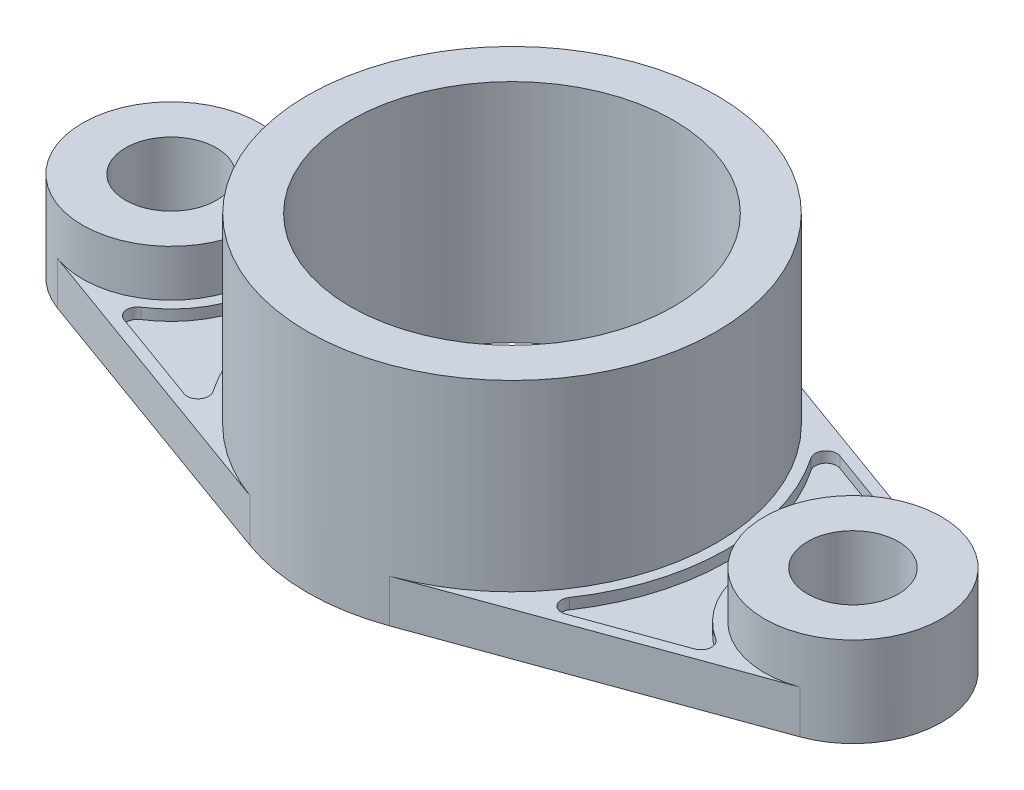
ISO-10303-21;
HEADER;
FILE_DESCRIPTION(('STEP AP214'),'2;1');
FILE_NAME('part.step','',(''),(''),'','','');
FILE_SCHEMA(('AUTOMOTIVE_DESIGN { 1 0 10303 214 1 1 1 1 }'));
ENDSEC;
DATA;
#1=APPLICATION_CONTEXT('core data for automotive mechanical design processes');
#2=APPLICATION_PROTOCOL_DEFINITION('international standard','automotive_design',2000,#1);
#3=PRODUCT_CONTEXT('',#1,'mechanical');
#4=PRODUCT('Part','Part','',(#3));
#5=PRODUCT_RELATED_PRODUCT_CATEGORY('part','',(#4));
#6=PRODUCT_DEFINITION_FORMATION('','',#4);
#7=PRODUCT_DEFINITION_CONTEXT('part definition',#1,'design');
#8=PRODUCT_DEFINITION('design','',#6,#7);
#9=PRODUCT_DEFINITION_SHAPE('','',#8);
#10=(LENGTH_UNIT() NAMED_UNIT(*) SI_UNIT(.MILLI.,.METRE.));
#11=(NAMED_UNIT(*) PLANE_ANGLE_UNIT() SI_UNIT($,.RADIAN.));
#12=(NAMED_UNIT(*) SI_UNIT($,.STERADIAN.) SOLID_ANGLE_UNIT());
#13=UNCERTAINTY_MEASURE_WITH_UNIT(LENGTH_MEASURE(1.E-05),#10,'distance_accuracy_value','');
#14=(GEOMETRIC_REPRESENTATION_CONTEXT(3) GLOBAL_UNCERTAINTY_ASSIGNED_CONTEXT((#13)) GLOBAL_UNIT_ASSIGNED_CONTEXT((#10,
#11,#12)) REPRESENTATION_CONTEXT('',''));
#15=CARTESIAN_POINT('',(0.,0.,0.));
#16=DIRECTION('',(0.,0.,1.));
#17=DIRECTION('',(1.,0.,0.));
#18=AXIS2_PLACEMENT_3D('',#15,#16,#17);
#19=CARTESIAN_POINT('',(0.,12.,0.));
#20=DIRECTION('',(0.,1.,0.));
#21=DIRECTION('',(0.,0.,1.));
#22=AXIS2_PLACEMENT_3D('',#19,#20,#21);
#23=PLANE('',#22);
#24=CARTESIAN_POINT('',(95.,12.,0.));
#25=DIRECTION('',(0.,-1.,0.));
#26=DIRECTION('',(0.,0.,-1.));
#27=AXIS2_PLACEMENT_3D('',#24,#25,#26);
#28=CIRCLE('',#27,27.6666666666667);
#29=CARTESIAN_POINT('',(80.0913652451194,12.,23.3061591471012));
#30=VERTEX_POINT('',#29);
#31=CARTESIAN_POINT('',(80.0913652451194,12.,-23.3061591471012));
#32=VERTEX_POINT('',#31);
#33=EDGE_CURVE('E64',#30,#32,#28,.T.);
#34=ORIENTED_EDGE('',*,*,#33,.F.);
#35=CARTESIAN_POINT('',(78.474766295795,12.,25.8333330305218));
#36=DIRECTION('',(0.,1.,0.));
#37=DIRECTION('',(0.,0.,-1.));
#38=AXIS2_PLACEMENT_3D('',#35,#36,#37);
#39=CIRCLE('',#38,3.);
#40=CARTESIAN_POINT('',(79.4958189273739,12.,28.6542285485348));
#41=VERTEX_POINT('',#40);
#42=EDGE_CURVE('E285',#41,#30,#39,.T.);
#43=ORIENTED_EDGE('',*,*,#42,.F.);
#44=DIRECTION('',(0.940298506004326,0.,-0.340350877192983));
#45=VECTOR('',#44,1.);
#46=CARTESIAN_POINT('',(79.4958189273739,12.,28.6542285485348));
#47=LINE('',#46,#45);
#48=CARTESIAN_POINT('',(53.1572830327243,12.,38.1877370444864));
#49=VERTEX_POINT('',#48);
#50=EDGE_CURVE('E323',#49,#41,#47,.T.);
#51=ORIENTED_EDGE('',*,*,#50,.F.);
#52=CARTESIAN_POINT('',(52.1362304011454,12.,35.3668415264735));
#53=DIRECTION('',(0.,1.,0.));
#54=DIRECTION('',(0.,0.,1.));
#55=AXIS2_PLACEMENT_3D('',#52,#53,#54);
#56=CIRCLE('',#55,3.);
#57=CARTESIAN_POINT('',(49.6535527629956,12.,33.682706215689));
#58=VERTEX_POINT('',#57);
#59=EDGE_CURVE('E320',#58,#49,#56,.T.);
#60=ORIENTED_EDGE('',*,*,#59,.F.);
#61=CARTESIAN_POINT('',(0.,12.,0.));
#62=DIRECTION('',(0.,-1.,0.));
#63=DIRECTION('',(0.,0.,-1.));
#64=AXIS2_PLACEMENT_3D('',#61,#62,#63);
#65=CIRCLE('',#64,60.);
#66=CARTESIAN_POINT('',(49.6535527629956,12.,-33.682706215689));
#67=VERTEX_POINT('',#66);
#68=EDGE_CURVE('E317',#67,#58,#65,.T.);
#69=ORIENTED_EDGE('',*,*,#68,.F.);
#70=CARTESIAN_POINT('',(52.1362304011453,12.,-35.3668415264735));
#71=DIRECTION('',(0.,1.,0.));
#72=DIRECTION('',(0.,0.,-1.));
#73=AXIS2_PLACEMENT_3D('',#70,#71,#72);
#74=CIRCLE('',#73,3.);
#75=CARTESIAN_POINT('',(53.1572830327243,12.,-38.1877370444864));
#76=VERTEX_POINT('',#75);
#77=EDGE_CURVE('E314',#76,#67,#74,.T.);
#78=ORIENTED_EDGE('',*,*,#77,.F.);
#79=DIRECTION('',(-0.940298506004326,0.,-0.340350877192983));
#80=VECTOR('',#79,1.);
#81=CARTESIAN_POINT('',(53.1572830327243,12.,-38.1877370444864));
#82=LINE('',#81,#80);
#83=CARTESIAN_POINT('',(79.4958189273739,12.,-28.6542285485348));
#84=VERTEX_POINT('',#83);
#85=EDGE_CURVE('E311',#84,#76,#82,.T.);
#86=ORIENTED_EDGE('',*,*,#85,.F.);
#87=CARTESIAN_POINT('',(78.474766295795,12.,-25.8333330305218));
#88=DIRECTION('',(0.,1.,0.));
#89=DIRECTION('',(0.,0.,-1.));
#90=AXIS2_PLACEMENT_3D('',#87,#88,#89);
#91=CIRCLE('',#90,3.);
#92=EDGE_CURVE('E308',#32,#84,#91,.T.);
#93=ORIENTED_EDGE('',*,*,#92,.F.);
#94=EDGE_LOOP('',(#34,#43,#51,#60,#69,#78,#86,#93));
#95=FACE_BOUND('',#94,.T.);
#96=CARTESIAN_POINT('',(0.,12.,0.));
#97=DIRECTION('',(0.,1.,0.));
#98=DIRECTION('',(0.,0.,1.));
#99=AXIS2_PLACEMENT_3D('',#96,#97,#98);
#100=CIRCLE('',#99,57.);
#101=CARTESIAN_POINT('',(19.4,12.,-53.5970148422466));
#102=VERTEX_POINT('',#101);
#103=CARTESIAN_POINT('',(19.4,12.,53.5970148422466));
#104=VERTEX_POINT('',#103);
#105=EDGE_CURVE('E347',#102,#104,#100,.F.);
#106=ORIENTED_EDGE('',*,*,#105,.T.);
#107=DIRECTION('',(-0.940298506004326,0.,0.340350877192983));
#108=VECTOR('',#107,1.);
#109=CARTESIAN_POINT('',(19.4,12.,53.5970148422466));
#110=LINE('',#109,#108);
#111=CARTESIAN_POINT('',(103.395321637427,12.,23.1940298147734));
#112=VERTEX_POINT('',#111);
#113=EDGE_CURVE('E373',#112,#104,#110,.T.);
#114=ORIENTED_EDGE('',*,*,#113,.F.);
#115=CARTESIAN_POINT('',(95.,12.,0.));
#116=DIRECTION('',(0.,1.,0.));
#117=DIRECTION('',(0.,0.,1.));
#118=AXIS2_PLACEMENT_3D('',#115,#116,#117);
#119=CIRCLE('',#118,24.6666666666667);
#120=CARTESIAN_POINT('',(103.395321637427,12.,-23.1940298147734));
#121=VERTEX_POINT('',#120);
#122=EDGE_CURVE('E365',#112,#121,#119,.F.);
#123=ORIENTED_EDGE('',*,*,#122,.T.);
#124=DIRECTION('',(-0.940298506004326,0.,-0.340350877192982));
#125=VECTOR('',#124,1.);
#126=CARTESIAN_POINT('',(19.4,12.,-53.5970148422466));
#127=LINE('',#126,#125);
#128=EDGE_CURVE('E376',#121,#102,#127,.T.);
#129=ORIENTED_EDGE('',*,*,#128,.T.);
#130=EDGE_LOOP('',(#106,#114,#123,#129));
#131=FACE_BOUND('',#130,.T.);
#132=ADVANCED_FACE('F49',(#95,#131),#23,.T.);
#133=CARTESIAN_POINT('',(0.,12.,0.));
#134=DIRECTION('',(0.,-1.,0.));
#135=DIRECTION('',(0.,0.,1.));
#136=AXIS2_PLACEMENT_3D('',#133,#134,#135);
#137=CIRCLE('',#136,60.);
#138=CARTESIAN_POINT('',(-49.6535527629956,12.,33.682706215689));
#139=VERTEX_POINT('',#138);
#140=CARTESIAN_POINT('',(-49.6535527629956,12.,-33.682706215689));
#141=VERTEX_POINT('',#140);
#142=EDGE_CURVE('E72',#139,#141,#137,.T.);
#143=ORIENTED_EDGE('',*,*,#142,.F.);
#144=CARTESIAN_POINT('',(-52.1362304011454,12.,35.3668415264735));
#145=DIRECTION('',(0.,1.,0.));
#146=DIRECTION('',(0.,0.,-1.));
#147=AXIS2_PLACEMENT_3D('',#144,#145,#146);
#148=CIRCLE('',#147,3.);
#149=CARTESIAN_POINT('',(-53.1572830327243,12.,38.1877370444864));
#150=VERTEX_POINT('',#149);
#151=EDGE_CURVE('E230',#150,#139,#148,.T.);
#152=ORIENTED_EDGE('',*,*,#151,.F.);
#153=DIRECTION('',(0.940298506004326,0.,0.340350877192983));
#154=VECTOR('',#153,1.);
#155=CARTESIAN_POINT('',(-79.4958189273739,12.,28.6542285485348));
#156=LINE('',#155,#154);
#157=CARTESIAN_POINT('',(-79.4958189273739,12.,28.6542285485348));
#158=VERTEX_POINT('',#157);
#159=EDGE_CURVE('E233',#158,#150,#156,.T.);
#160=ORIENTED_EDGE('',*,*,#159,.F.);
#161=CARTESIAN_POINT('',(-78.474766295795,12.,25.8333330305218));
#162=DIRECTION('',(0.,1.,0.));
#163=DIRECTION('',(0.,0.,1.));
#164=AXIS2_PLACEMENT_3D('',#161,#162,#163);
#165=CIRCLE('',#164,3.);
#166=CARTESIAN_POINT('',(-80.0913652451194,12.,23.3061591471012));
#167=VERTEX_POINT('',#166);
#168=EDGE_CURVE('E262',#167,#158,#165,.T.);
#169=ORIENTED_EDGE('',*,*,#168,.F.);
#170=CARTESIAN_POINT('',(-95.,12.,0.));
#171=DIRECTION('',(0.,-1.,0.));
#172=DIRECTION('',(0.,0.,1.));
#173=AXIS2_PLACEMENT_3D('',#170,#171,#172);
#174=CIRCLE('',#173,27.6666666666667);
#175=CARTESIAN_POINT('',(-80.0913652451194,12.,-23.3061591471012));
#176=VERTEX_POINT('',#175);
#177=EDGE_CURVE('E259',#176,#167,#174,.T.);
#178=ORIENTED_EDGE('',*,*,#177,.F.);
#179=CARTESIAN_POINT('',(-78.474766295795,12.,-25.8333330305218));
#180=DIRECTION('',(0.,1.,0.));
#181=DIRECTION('',(0.,0.,1.));
#182=AXIS2_PLACEMENT_3D('',#179,#180,#181);
#183=CIRCLE('',#182,3.);
#184=CARTESIAN_POINT('',(-79.4958189273739,12.,-28.6542285485348));
#185=VERTEX_POINT('',#184);
#186=EDGE_CURVE('E256',#185,#176,#183,.T.);
#187=ORIENTED_EDGE('',*,*,#186,.F.);
#188=DIRECTION('',(-0.940298506004326,0.,0.340350877192983));
#189=VECTOR('',#188,1.);
#190=CARTESIAN_POINT('',(-53.1572830327243,12.,-38.1877370444864));
#191=LINE('',#190,#189);
#192=CARTESIAN_POINT('',(-53.1572830327243,12.,-38.1877370444864));
#193=VERTEX_POINT('',#192);
#194=EDGE_CURVE('E253',#193,#185,#191,.T.);
#195=ORIENTED_EDGE('',*,*,#194,.F.);
#196=CARTESIAN_POINT('',(-52.1362304011453,12.,-35.3668415264735));
#197=DIRECTION('',(0.,1.,0.));
#198=DIRECTION('',(0.,0.,1.));
#199=AXIS2_PLACEMENT_3D('',#196,#197,#198);
#200=CIRCLE('',#199,3.);
#201=EDGE_CURVE('E250',#141,#193,#200,.T.);
#202=ORIENTED_EDGE('',*,*,#201,.F.);
#203=EDGE_LOOP('',(#143,#152,#160,#169,#178,#187,#195,#202));
#204=FACE_BOUND('',#203,.T.);
#205=CARTESIAN_POINT('',(-19.4,12.,53.5970148422466));
#206=VERTEX_POINT('',#205);
#207=CARTESIAN_POINT('',(-19.4,12.,-53.5970148422466));
#208=VERTEX_POINT('',#207);
#209=EDGE_CURVE('E348',#206,#208,#100,.F.);
#210=ORIENTED_EDGE('',*,*,#209,.T.);
#211=DIRECTION('',(0.940298506004326,0.,-0.340350877192982));
#212=VECTOR('',#211,1.);
#213=CARTESIAN_POINT('',(-19.4,12.,-53.5970148422466));
#214=LINE('',#213,#212);
#215=CARTESIAN_POINT('',(-103.395321637427,12.,-23.1940298147734));
#216=VERTEX_POINT('',#215);
#217=EDGE_CURVE('E368',#216,#208,#214,.T.);
#218=ORIENTED_EDGE('',*,*,#217,.F.);
#219=CARTESIAN_POINT('',(-95.,12.,0.));
#220=DIRECTION('',(0.,1.,0.));
#221=DIRECTION('',(0.,0.,1.));
#222=AXIS2_PLACEMENT_3D('',#219,#220,#221);
#223=CIRCLE('',#222,24.6666666666667);
#224=CARTESIAN_POINT('',(-103.395321637427,12.,23.1940298147734));
#225=VERTEX_POINT('',#224);
#226=EDGE_CURVE('E357',#216,#225,#223,.F.);
#227=ORIENTED_EDGE('',*,*,#226,.T.);
#228=DIRECTION('',(0.940298506004326,0.,0.340350877192982));
#229=VECTOR('',#228,1.);
#230=CARTESIAN_POINT('',(-19.4,12.,53.5970148422466));
#231=LINE('',#230,#229);
#232=EDGE_CURVE('E370',#225,#206,#231,.T.);
#233=ORIENTED_EDGE('',*,*,#232,.T.);
#234=EDGE_LOOP('',(#210,#218,#227,#233));
#235=FACE_BOUND('',#234,.T.);
#236=ADVANCED_FACE('F444',(#204,#235),#23,.T.);
#237=CARTESIAN_POINT('',(-19.4,12.,-53.5970148422466));
#238=DIRECTION('',(-0.340350877192982,0.,-0.940298506004326));
#239=DIRECTION('',(-0.940298506004326,0.,0.340350877192982));
#240=AXIS2_PLACEMENT_3D('',#237,#238,#239);
#241=PLANE('',#240);
#242=DIRECTION('',(0.940298506004326,0.,-0.340350877192982));
#243=VECTOR('',#242,1.);
#244=CARTESIAN_POINT('',(-19.4,0.,-53.5970148422466));
#245=LINE('',#244,#243);
#246=CARTESIAN_POINT('',(-103.395321637427,0.,-23.1940298147734));
#247=VERTEX_POINT('',#246);
#248=CARTESIAN_POINT('',(-19.4,0.,-53.5970148422466));
#249=VERTEX_POINT('',#248);
#250=EDGE_CURVE('E367',#247,#249,#245,.T.);
#251=ORIENTED_EDGE('',*,*,#250,.F.);
#252=DIRECTION('',(0.,-1.,0.));
#253=VECTOR('',#252,1.);
#254=CARTESIAN_POINT('',(-103.395321637427,12.,-23.1940298147734));
#255=LINE('',#254,#253);
#256=EDGE_CURVE('E12',#216,#247,#255,.T.);
#257=ORIENTED_EDGE('',*,*,#256,.F.);
#258=ORIENTED_EDGE('',*,*,#217,.T.);
#259=DIRECTION('',(0.,-1.,0.));
#260=VECTOR('',#259,1.);
#261=CARTESIAN_POINT('',(-19.4,12.,-53.5970148422466));
#262=LINE('',#261,#260);
#263=EDGE_CURVE('E378',#208,#249,#262,.T.);
#264=ORIENTED_EDGE('',*,*,#263,.T.);
#265=EDGE_LOOP('',(#251,#257,#258,#264));
#266=FACE_BOUND('',#265,.T.);
#267=ADVANCED_FACE('F51',(#266),#241,.T.);
#268=CARTESIAN_POINT('',(-95.,12.,0.));
#269=DIRECTION('',(0.,-1.,0.));
#270=DIRECTION('',(0.,0.,-1.));
#271=AXIS2_PLACEMENT_3D('',#268,#269,#270);
#272=CYLINDRICAL_SURFACE('',#271,24.6666666666667);
#273=CARTESIAN_POINT('',(-95.,0.,0.));
#274=DIRECTION('',(0.,1.,0.));
#275=DIRECTION('',(0.,0.,1.));
#276=AXIS2_PLACEMENT_3D('',#273,#274,#275);
#277=CIRCLE('',#276,24.6666666666667);
#278=CARTESIAN_POINT('',(-103.395321637427,0.,23.1940298147734));
#279=VERTEX_POINT('',#278);
#280=EDGE_CURVE('E381',#247,#279,#277,.T.);
#281=ORIENTED_EDGE('',*,*,#280,.T.);
#282=DIRECTION('',(0.,-1.,0.));
#283=VECTOR('',#282,1.);
#284=CARTESIAN_POINT('',(-103.395321637427,12.,23.1940298147734));
#285=LINE('',#284,#283);
#286=EDGE_CURVE('E57',#225,#279,#285,.T.);
#287=ORIENTED_EDGE('',*,*,#286,.F.);
#288=ORIENTED_EDGE('',*,*,#226,.F.);
#289=ORIENTED_EDGE('',*,*,#256,.T.);
#290=EDGE_LOOP('',(#281,#287,#288,#289));
#291=FACE_BOUND('',#290,.T.);
#292=CARTESIAN_POINT('',(-95.,25.,0.));
#293=DIRECTION('',(0.,1.,0.));
#294=DIRECTION('',(0.,0.,1.));
#295=AXIS2_PLACEMENT_3D('',#292,#293,#294);
#296=CIRCLE('',#295,24.6666666666667);
#297=CARTESIAN_POINT('',(-95.,25.,24.6666666666667));
#298=VERTEX_POINT('',#297);
#299=EDGE_CURVE('E351',#298,#298,#296,.T.);
#300=ORIENTED_EDGE('',*,*,#299,.F.);
#301=EDGE_LOOP('',(#300));
#302=FACE_BOUND('',#301,.T.);
#303=ADVANCED_FACE('F446',(#291,#302),#272,.T.);
#304=CARTESIAN_POINT('',(-19.4,12.,53.5970148422466));
#305=DIRECTION('',(0.340350877192982,0.,-0.940298506004326));
#306=DIRECTION('',(-0.940298506004326,0.,-0.340350877192982));
#307=AXIS2_PLACEMENT_3D('',#304,#305,#306);
#308=PLANE('',#307);
#309=DIRECTION('',(0.940298506004326,0.,0.340350877192982));
#310=VECTOR('',#309,1.);
#311=CARTESIAN_POINT('',(-19.4,0.,53.5970148422466));
#312=LINE('',#311,#310);
#313=CARTESIAN_POINT('',(-19.4,0.,53.5970148422466));
#314=VERTEX_POINT('',#313);
#315=EDGE_CURVE('E383',#279,#314,#312,.T.);
#316=ORIENTED_EDGE('',*,*,#315,.T.);
#317=DIRECTION('',(0.,-1.,0.));
#318=VECTOR('',#317,1.);
#319=CARTESIAN_POINT('',(-19.4,12.,53.5970148422466));
#320=LINE('',#319,#318);
#321=EDGE_CURVE('E417',#206,#314,#320,.T.);
#322=ORIENTED_EDGE('',*,*,#321,.F.);
#323=ORIENTED_EDGE('',*,*,#232,.F.);
#324=ORIENTED_EDGE('',*,*,#286,.T.);
#325=EDGE_LOOP('',(#316,#322,#323,#324));
#326=FACE_BOUND('',#325,.T.);
#327=ADVANCED_FACE('F424',(#326),#308,.F.);
#328=CARTESIAN_POINT('',(19.4,12.,53.5970148422466));
#329=DIRECTION('',(0.340350877192983,0.,0.940298506004326));
#330=DIRECTION('',(0.940298506004326,0.,-0.340350877192983));
#331=AXIS2_PLACEMENT_3D('',#328,#329,#330);
#332=PLANE('',#331);
#333=DIRECTION('',(-0.940298506004326,0.,0.340350877192983));
#334=VECTOR('',#333,1.);
#335=CARTESIAN_POINT('',(19.4,0.,53.5970148422466));
#336=LINE('',#335,#334);
#337=CARTESIAN_POINT('',(103.395321637427,0.,23.1940298147734));
#338=VERTEX_POINT('',#337);
#339=CARTESIAN_POINT('',(19.4,0.,53.5970148422466));
#340=VERTEX_POINT('',#339);
#341=EDGE_CURVE('E388',#338,#340,#336,.T.);
#342=ORIENTED_EDGE('',*,*,#341,.F.);
#343=DIRECTION('',(0.,-1.,0.));
#344=VECTOR('',#343,1.);
#345=CARTESIAN_POINT('',(103.395321637427,12.,23.1940298147734));
#346=LINE('',#345,#344);
#347=EDGE_CURVE('E413',#112,#338,#346,.T.);
#348=ORIENTED_EDGE('',*,*,#347,.F.);
#349=ORIENTED_EDGE('',*,*,#113,.T.);
#350=DIRECTION('',(0.,-1.,0.));
#351=VECTOR('',#350,1.);
#352=CARTESIAN_POINT('',(19.4,12.,53.5970148422466));
#353=LINE('',#352,#351);
#354=EDGE_CURVE('E415',#104,#340,#353,.T.);
#355=ORIENTED_EDGE('',*,*,#354,.T.);
#356=EDGE_LOOP('',(#342,#348,#349,#355));
#357=FACE_BOUND('',#356,.T.);
#358=ADVANCED_FACE('F461',(#357),#332,.T.);
#359=CARTESIAN_POINT('',(95.,12.,0.));
#360=DIRECTION('',(0.,-1.,0.));
#361=DIRECTION('',(0.,0.,-1.));
#362=AXIS2_PLACEMENT_3D('',#359,#360,#361);
#363=CYLINDRICAL_SURFACE('',#362,24.6666666666667);
#364=CARTESIAN_POINT('',(95.,0.,0.));
#365=DIRECTION('',(0.,1.,0.));
#366=DIRECTION('',(0.,0.,1.));
#367=AXIS2_PLACEMENT_3D('',#364,#365,#366);
#368=CIRCLE('',#367,24.6666666666667);
#369=CARTESIAN_POINT('',(103.395321637427,0.,-23.1940298147734));
#370=VERTEX_POINT('',#369);
#371=EDGE_CURVE('E391',#338,#370,#368,.T.);
#372=ORIENTED_EDGE('',*,*,#371,.T.);
#373=DIRECTION('',(0.,-1.,0.));
#374=VECTOR('',#373,1.);
#375=CARTESIAN_POINT('',(103.395321637427,12.,-23.1940298147734));
#376=LINE('',#375,#374);
#377=EDGE_CURVE('E410',#121,#370,#376,.T.);
#378=ORIENTED_EDGE('',*,*,#377,.F.);
#379=ORIENTED_EDGE('',*,*,#122,.F.);
#380=ORIENTED_EDGE('',*,*,#347,.T.);
#381=EDGE_LOOP('',(#372,#378,#379,#380));
#382=FACE_BOUND('',#381,.T.);
#383=CARTESIAN_POINT('',(95.,25.,0.));
#384=DIRECTION('',(0.,1.,0.));
#385=DIRECTION('',(0.,0.,1.));
#386=AXIS2_PLACEMENT_3D('',#383,#384,#385);
#387=CIRCLE('',#386,24.6666666666667);
#388=CARTESIAN_POINT('',(95.,25.,24.6666666666666));
#389=VERTEX_POINT('',#388);
#390=EDGE_CURVE('E362',#389,#389,#387,.T.);
#391=ORIENTED_EDGE('',*,*,#390,.F.);
#392=EDGE_LOOP('',(#391));
#393=FACE_BOUND('',#392,.T.);
#394=ADVANCED_FACE('F457',(#382,#393),#363,.T.);
#395=CARTESIAN_POINT('',(19.4,12.,-53.5970148422466));
#396=DIRECTION('',(-0.340350877192982,0.,0.940298506004326));
#397=DIRECTION('',(0.940298506004326,0.,0.340350877192982));
#398=AXIS2_PLACEMENT_3D('',#395,#396,#397);
#399=PLANE('',#398);
#400=DIRECTION('',(-0.940298506004326,0.,-0.340350877192982));
#401=VECTOR('',#400,1.);
#402=CARTESIAN_POINT('',(19.4,0.,-53.5970148422466));
#403=LINE('',#402,#401);
#404=CARTESIAN_POINT('',(19.4,0.,-53.5970148422466));
#405=VERTEX_POINT('',#404);
#406=EDGE_CURVE('E393',#370,#405,#403,.T.);
#407=ORIENTED_EDGE('',*,*,#406,.T.);
#408=DIRECTION('',(0.,-1.,0.));
#409=VECTOR('',#408,1.);
#410=CARTESIAN_POINT('',(19.4,12.,-53.5970148422466));
#411=LINE('',#410,#409);
#412=EDGE_CURVE('E407',#102,#405,#411,.T.);
#413=ORIENTED_EDGE('',*,*,#412,.F.);
#414=ORIENTED_EDGE('',*,*,#128,.F.);
#415=ORIENTED_EDGE('',*,*,#377,.T.);
#416=EDGE_LOOP('',(#407,#413,#414,#415));
#417=FACE_BOUND('',#416,.T.);
#418=ADVANCED_FACE('F454',(#417),#399,.F.);
#419=CARTESIAN_POINT('',(95.,12.,0.));
#420=DIRECTION('',(0.,-1.,0.));
#421=DIRECTION('',(0.,0.,-1.));
#422=AXIS2_PLACEMENT_3D('',#419,#420,#421);
#423=CYLINDRICAL_SURFACE('',#422,12.6666666666667);
#424=CARTESIAN_POINT('',(95.,0.,0.));
#425=DIRECTION('',(0.,1.,0.));
#426=DIRECTION('',(0.,0.,1.));
#427=AXIS2_PLACEMENT_3D('',#424,#425,#426);
#428=CIRCLE('',#427,12.6666666666667);
#429=CARTESIAN_POINT('',(95.,0.,12.6666666666666));
#430=VERTEX_POINT('',#429);
#431=EDGE_CURVE('E401',#430,#430,#428,.T.);
#432=ORIENTED_EDGE('',*,*,#431,.F.);
#433=EDGE_LOOP('',(#432));
#434=FACE_BOUND('',#433,.T.);
#435=CARTESIAN_POINT('',(95.,25.,0.));
#436=DIRECTION('',(0.,1.,0.));
#437=DIRECTION('',(0.,0.,1.));
#438=AXIS2_PLACEMENT_3D('',#435,#436,#437);
#439=CIRCLE('',#438,12.6666666666667);
#440=CARTESIAN_POINT('',(95.,25.,12.6666666666666));
#441=VERTEX_POINT('',#440);
#442=EDGE_CURVE('E359',#441,#441,#439,.T.);
#443=ORIENTED_EDGE('',*,*,#442,.T.);
#444=EDGE_LOOP('',(#443));
#445=FACE_BOUND('',#444,.T.);
#446=ADVANCED_FACE('F481',(#434,#445),#423,.F.);
#447=CARTESIAN_POINT('',(0.,12.,0.));
#448=DIRECTION('',(0.,-1.,0.));
#449=DIRECTION('',(0.,0.,-1.));
#450=AXIS2_PLACEMENT_3D('',#447,#448,#449);
#451=CYLINDRICAL_SURFACE('',#450,45.);
#452=CARTESIAN_POINT('',(0.,0.,0.));
#453=DIRECTION('',(0.,1.,0.));
#454=DIRECTION('',(0.,0.,1.));
#455=AXIS2_PLACEMENT_3D('',#452,#453,#454);
#456=CIRCLE('',#455,45.);
#457=CARTESIAN_POINT('',(0.,0.,45.));
#458=VERTEX_POINT('',#457);
#459=EDGE_CURVE('E398',#458,#458,#456,.T.);
#460=ORIENTED_EDGE('',*,*,#459,.F.);
#461=EDGE_LOOP('',(#460));
#462=FACE_BOUND('',#461,.T.);
#463=CARTESIAN_POINT('',(0.,63.,0.));
#464=DIRECTION('',(0.,1.,0.));
#465=DIRECTION('',(0.,0.,1.));
#466=AXIS2_PLACEMENT_3D('',#463,#464,#465);
#467=CIRCLE('',#466,45.);
#468=CARTESIAN_POINT('',(0.,63.,45.));
#469=VERTEX_POINT('',#468);
#470=EDGE_CURVE('E269',#469,#469,#467,.T.);
#471=ORIENTED_EDGE('',*,*,#470,.T.);
#472=EDGE_LOOP('',(#471));
#473=FACE_BOUND('',#472,.T.);
#474=ADVANCED_FACE('F484',(#462,#473),#451,.F.);
#475=CARTESIAN_POINT('',(0.,12.,0.));
#476=DIRECTION('',(0.,-1.,0.));
#477=DIRECTION('',(0.,0.,-1.));
#478=AXIS2_PLACEMENT_3D('',#475,#476,#477);
#479=CYLINDRICAL_SURFACE('',#478,57.);
#480=CARTESIAN_POINT('',(0.,0.,0.));
#481=DIRECTION('',(0.,1.,0.));
#482=DIRECTION('',(0.,0.,1.));
#483=AXIS2_PLACEMENT_3D('',#480,#481,#482);
#484=CIRCLE('',#483,57.);
#485=EDGE_CURVE('E395',#405,#249,#484,.T.);
#486=ORIENTED_EDGE('',*,*,#485,.T.);
#487=ORIENTED_EDGE('',*,*,#263,.F.);
#488=ORIENTED_EDGE('',*,*,#209,.F.);
#489=ORIENTED_EDGE('',*,*,#321,.T.);
#490=CARTESIAN_POINT('',(0.,0.,0.));
#491=DIRECTION('',(0.,1.,0.));
#492=DIRECTION('',(0.,0.,1.));
#493=AXIS2_PLACEMENT_3D('',#490,#491,#492);
#494=CIRCLE('',#493,57.);
#495=EDGE_CURVE('E385',#314,#340,#494,.T.);
#496=ORIENTED_EDGE('',*,*,#495,.T.);
#497=ORIENTED_EDGE('',*,*,#354,.F.);
#498=ORIENTED_EDGE('',*,*,#105,.F.);
#499=ORIENTED_EDGE('',*,*,#412,.T.);
#500=EDGE_LOOP('',(#486,#487,#488,#489,#496,#497,#498,#499));
#501=FACE_BOUND('',#500,.T.);
#502=CARTESIAN_POINT('',(0.,63.,0.));
#503=DIRECTION('',(0.,1.,0.));
#504=DIRECTION('',(0.,0.,1.));
#505=AXIS2_PLACEMENT_3D('',#502,#503,#504);
#506=CIRCLE('',#505,57.);
#507=CARTESIAN_POINT('',(0.,63.,57.));
#508=VERTEX_POINT('',#507);
#509=EDGE_CURVE('E344',#508,#508,#506,.T.);
#510=ORIENTED_EDGE('',*,*,#509,.F.);
#511=EDGE_LOOP('',(#510));
#512=FACE_BOUND('',#511,.T.);
#513=ADVANCED_FACE('F437',(#501,#512),#479,.T.);
#514=CARTESIAN_POINT('',(-95.,12.,0.));
#515=DIRECTION('',(0.,-1.,0.));
#516=DIRECTION('',(0.,0.,-1.));
#517=AXIS2_PLACEMENT_3D('',#514,#515,#516);
#518=CYLINDRICAL_SURFACE('',#517,12.6666666666667);
#519=CARTESIAN_POINT('',(-95.,0.,0.));
#520=DIRECTION('',(0.,1.,0.));
#521=DIRECTION('',(0.,0.,1.));
#522=AXIS2_PLACEMENT_3D('',#519,#520,#521);
#523=CIRCLE('',#522,12.6666666666667);
#524=CARTESIAN_POINT('',(-95.,0.,12.6666666666667));
#525=VERTEX_POINT('',#524);
#526=EDGE_CURVE('E371',#525,#525,#523,.T.);
#527=ORIENTED_EDGE('',*,*,#526,.F.);
#528=EDGE_LOOP('',(#527));
#529=FACE_BOUND('',#528,.T.);
#530=CARTESIAN_POINT('',(-95.,25.,0.));
#531=DIRECTION('',(0.,1.,0.));
#532=DIRECTION('',(0.,0.,1.));
#533=AXIS2_PLACEMENT_3D('',#530,#531,#532);
#534=CIRCLE('',#533,12.6666666666667);
#535=CARTESIAN_POINT('',(-95.,25.,12.6666666666667));
#536=VERTEX_POINT('',#535);
#537=EDGE_CURVE('E354',#536,#536,#534,.T.);
#538=ORIENTED_EDGE('',*,*,#537,.T.);
#539=EDGE_LOOP('',(#538));
#540=FACE_BOUND('',#539,.T.);
#541=ADVANCED_FACE('F477',(#529,#540),#518,.F.);
#542=CARTESIAN_POINT('',(0.,0.,0.));
#543=DIRECTION('',(0.,1.,0.));
#544=DIRECTION('',(0.,0.,1.));
#545=AXIS2_PLACEMENT_3D('',#542,#543,#544);
#546=PLANE('',#545);
#547=ORIENTED_EDGE('',*,*,#280,.F.);
#548=ORIENTED_EDGE('',*,*,#250,.T.);
#549=ORIENTED_EDGE('',*,*,#485,.F.);
#550=ORIENTED_EDGE('',*,*,#406,.F.);
#551=ORIENTED_EDGE('',*,*,#371,.F.);
#552=ORIENTED_EDGE('',*,*,#341,.T.);
#553=ORIENTED_EDGE('',*,*,#495,.F.);
#554=ORIENTED_EDGE('',*,*,#315,.F.);
#555=EDGE_LOOP('',(#547,#548,#549,#550,#551,#552,#553,#554));
#556=FACE_BOUND('',#555,.T.);
#557=ORIENTED_EDGE('',*,*,#526,.T.);
#558=EDGE_LOOP('',(#557));
#559=FACE_BOUND('',#558,.T.);
#560=ORIENTED_EDGE('',*,*,#431,.T.);
#561=EDGE_LOOP('',(#560));
#562=FACE_BOUND('',#561,.T.);
#563=ORIENTED_EDGE('',*,*,#459,.T.);
#564=EDGE_LOOP('',(#563));
#565=FACE_BOUND('',#564,.T.);
#566=ADVANCED_FACE('F430',(#556,#559,#562,#565),#546,.F.);
#567=CARTESIAN_POINT('',(0.,25.,0.));
#568=DIRECTION('',(0.,1.,0.));
#569=DIRECTION('',(0.,0.,1.));
#570=AXIS2_PLACEMENT_3D('',#567,#568,#569);
#571=PLANE('',#570);
#572=ORIENTED_EDGE('',*,*,#442,.F.);
#573=EDGE_LOOP('',(#572));
#574=FACE_BOUND('',#573,.T.);
#575=ORIENTED_EDGE('',*,*,#390,.T.);
#576=EDGE_LOOP('',(#575));
#577=FACE_BOUND('',#576,.T.);
#578=ADVANCED_FACE('F473',(#574,#577),#571,.T.);
#579=CARTESIAN_POINT('',(0.,25.,0.));
#580=DIRECTION('',(0.,1.,0.));
#581=DIRECTION('',(0.,0.,1.));
#582=AXIS2_PLACEMENT_3D('',#579,#580,#581);
#583=PLANE('',#582);
#584=ORIENTED_EDGE('',*,*,#299,.T.);
#585=EDGE_LOOP('',(#584));
#586=FACE_BOUND('',#585,.T.);
#587=ORIENTED_EDGE('',*,*,#537,.F.);
#588=EDGE_LOOP('',(#587));
#589=FACE_BOUND('',#588,.T.);
#590=ADVANCED_FACE('F694',(#586,#589),#583,.T.);
#591=CARTESIAN_POINT('',(0.,63.,0.));
#592=DIRECTION('',(0.,1.,0.));
#593=DIRECTION('',(0.,0.,1.));
#594=AXIS2_PLACEMENT_3D('',#591,#592,#593);
#595=PLANE('',#594);
#596=ORIENTED_EDGE('',*,*,#509,.T.);
#597=EDGE_LOOP('',(#596));
#598=FACE_BOUND('',#597,.T.);
#599=ORIENTED_EDGE('',*,*,#470,.F.);
#600=EDGE_LOOP('',(#599));
#601=FACE_BOUND('',#600,.T.);
#602=ADVANCED_FACE('F523',(#598,#601),#595,.T.);
#603=CARTESIAN_POINT('',(0.,9.,0.));
#604=DIRECTION('',(0.,1.,0.));
#605=DIRECTION('',(0.,0.,1.));
#606=AXIS2_PLACEMENT_3D('',#603,#604,#605);
#607=CYLINDRICAL_SURFACE('',#606,60.);
#608=ORIENTED_EDGE('',*,*,#142,.T.);
#609=DIRECTION('',(0.,1.,0.));
#610=VECTOR('',#609,1.);
#611=CARTESIAN_POINT('',(-49.6535527629956,9.,-33.682706215689));
#612=LINE('',#611,#610);
#613=CARTESIAN_POINT('',(-49.6535527629956,9.,-33.682706215689));
#614=VERTEX_POINT('',#613);
#615=EDGE_CURVE('E207',#614,#141,#612,.T.);
#616=ORIENTED_EDGE('',*,*,#615,.F.);
#617=CARTESIAN_POINT('',(0.,9.,0.));
#618=DIRECTION('',(0.,-1.,0.));
#619=DIRECTION('',(0.,0.,1.));
#620=AXIS2_PLACEMENT_3D('',#617,#618,#619);
#621=CIRCLE('',#620,60.);
#622=CARTESIAN_POINT('',(-49.6535527629956,9.,33.682706215689));
#623=VERTEX_POINT('',#622);
#624=EDGE_CURVE('E211',#623,#614,#621,.T.);
#625=ORIENTED_EDGE('',*,*,#624,.F.);
#626=DIRECTION('',(0.,1.,0.));
#627=VECTOR('',#626,1.);
#628=CARTESIAN_POINT('',(-49.6535527629956,9.,33.682706215689));
#629=LINE('',#628,#627);
#630=EDGE_CURVE('E267',#623,#139,#629,.T.);
#631=ORIENTED_EDGE('',*,*,#630,.T.);
#632=EDGE_LOOP('',(#608,#616,#625,#631));
#633=FACE_BOUND('',#632,.T.);
#634=ADVANCED_FACE('F209',(#633),#607,.T.);
#635=CARTESIAN_POINT('',(-52.1362304011454,9.,35.3668415264735));
#636=DIRECTION('',(0.,1.,0.));
#637=DIRECTION('',(0.,0.,1.));
#638=AXIS2_PLACEMENT_3D('',#635,#636,#637);
#639=CYLINDRICAL_SURFACE('',#638,3.);
#640=ORIENTED_EDGE('',*,*,#151,.T.);
#641=ORIENTED_EDGE('',*,*,#630,.F.);
#642=CARTESIAN_POINT('',(-52.1362304011454,9.,35.3668415264735));
#643=DIRECTION('',(0.,1.,0.));
#644=DIRECTION('',(0.,0.,-1.));
#645=AXIS2_PLACEMENT_3D('',#642,#643,#644);
#646=CIRCLE('',#645,3.);
#647=CARTESIAN_POINT('',(-53.1572830327243,9.,38.1877370444864));
#648=VERTEX_POINT('',#647);
#649=EDGE_CURVE('E217',#648,#623,#646,.T.);
#650=ORIENTED_EDGE('',*,*,#649,.F.);
#651=DIRECTION('',(0.,1.,0.));
#652=VECTOR('',#651,1.);
#653=CARTESIAN_POINT('',(-53.1572830327243,9.,38.1877370444864));
#654=LINE('',#653,#652);
#655=EDGE_CURVE('E270',#648,#150,#654,.T.);
#656=ORIENTED_EDGE('',*,*,#655,.T.);
#657=EDGE_LOOP('',(#640,#641,#650,#656));
#658=FACE_BOUND('',#657,.T.);
#659=ADVANCED_FACE('F522',(#658),#639,.F.);
#660=CARTESIAN_POINT('',(-79.4958189273739,9.,28.6542285485348));
#661=DIRECTION('',(-0.340350877192982,0.,0.940298506004326));
#662=DIRECTION('',(0.940298506004326,0.,0.340350877192982));
#663=AXIS2_PLACEMENT_3D('',#660,#661,#662);
#664=PLANE('',#663);
#665=ORIENTED_EDGE('',*,*,#159,.T.);
#666=ORIENTED_EDGE('',*,*,#655,.F.);
#667=DIRECTION('',(0.940298506004326,0.,0.340350877192983));
#668=VECTOR('',#667,1.);
#669=CARTESIAN_POINT('',(-79.4958189273739,9.,28.6542285485348));
#670=LINE('',#669,#668);
#671=CARTESIAN_POINT('',(-79.4958189273739,9.,28.6542285485348));
#672=VERTEX_POINT('',#671);
#673=EDGE_CURVE('E246',#672,#648,#670,.T.);
#674=ORIENTED_EDGE('',*,*,#673,.F.);
#675=DIRECTION('',(0.,1.,0.));
#676=VECTOR('',#675,1.);
#677=CARTESIAN_POINT('',(-79.4958189273739,9.,28.6542285485348));
#678=LINE('',#677,#676);
#679=EDGE_CURVE('E272',#672,#158,#678,.T.);
#680=ORIENTED_EDGE('',*,*,#679,.T.);
#681=EDGE_LOOP('',(#665,#666,#674,#680));
#682=FACE_BOUND('',#681,.T.);
#683=ADVANCED_FACE('F534',(#682),#664,.F.);
#684=CARTESIAN_POINT('',(-78.474766295795,9.,25.8333330305218));
#685=DIRECTION('',(0.,1.,0.));
#686=DIRECTION('',(0.,0.,1.));
#687=AXIS2_PLACEMENT_3D('',#684,#685,#686);
#688=CYLINDRICAL_SURFACE('',#687,3.);
#689=ORIENTED_EDGE('',*,*,#168,.T.);
#690=ORIENTED_EDGE('',*,*,#679,.F.);
#691=CARTESIAN_POINT('',(-78.474766295795,9.,25.8333330305218));
#692=DIRECTION('',(0.,1.,0.));
#693=DIRECTION('',(0.,0.,1.));
#694=AXIS2_PLACEMENT_3D('',#691,#692,#693);
#695=CIRCLE('',#694,3.);
#696=CARTESIAN_POINT('',(-80.0913652451194,9.,23.3061591471012));
#697=VERTEX_POINT('',#696);
#698=EDGE_CURVE('E243',#697,#672,#695,.T.);
#699=ORIENTED_EDGE('',*,*,#698,.F.);
#700=DIRECTION('',(0.,1.,0.));
#701=VECTOR('',#700,1.);
#702=CARTESIAN_POINT('',(-80.0913652451194,9.,23.3061591471012));
#703=LINE('',#702,#701);
#704=EDGE_CURVE('E274',#697,#167,#703,.T.);
#705=ORIENTED_EDGE('',*,*,#704,.T.);
#706=EDGE_LOOP('',(#689,#690,#699,#705));
#707=FACE_BOUND('',#706,.T.);
#708=ADVANCED_FACE('F544',(#707),#688,.F.);
#709=CARTESIAN_POINT('',(-95.,9.,0.));
#710=DIRECTION('',(0.,1.,0.));
#711=DIRECTION('',(0.,0.,1.));
#712=AXIS2_PLACEMENT_3D('',#709,#710,#711);
#713=CYLINDRICAL_SURFACE('',#712,27.6666666666667);
#714=ORIENTED_EDGE('',*,*,#177,.T.);
#715=ORIENTED_EDGE('',*,*,#704,.F.);
#716=CARTESIAN_POINT('',(-95.,9.,0.));
#717=DIRECTION('',(0.,-1.,0.));
#718=DIRECTION('',(0.,0.,1.));
#719=AXIS2_PLACEMENT_3D('',#716,#717,#718);
#720=CIRCLE('',#719,27.6666666666667);
#721=CARTESIAN_POINT('',(-80.0913652451194,9.,-23.3061591471012));
#722=VERTEX_POINT('',#721);
#723=EDGE_CURVE('E240',#722,#697,#720,.T.);
#724=ORIENTED_EDGE('',*,*,#723,.F.);
#725=DIRECTION('',(0.,1.,0.));
#726=VECTOR('',#725,1.);
#727=CARTESIAN_POINT('',(-80.0913652451194,9.,-23.3061591471012));
#728=LINE('',#727,#726);
#729=EDGE_CURVE('E276',#722,#176,#728,.T.);
#730=ORIENTED_EDGE('',*,*,#729,.T.);
#731=EDGE_LOOP('',(#714,#715,#724,#730));
#732=FACE_BOUND('',#731,.T.);
#733=ADVANCED_FACE('F554',(#732),#713,.T.);
#734=CARTESIAN_POINT('',(-78.474766295795,9.,-25.8333330305218));
#735=DIRECTION('',(0.,1.,0.));
#736=DIRECTION('',(0.,0.,1.));
#737=AXIS2_PLACEMENT_3D('',#734,#735,#736);
#738=CYLINDRICAL_SURFACE('',#737,3.);
#739=ORIENTED_EDGE('',*,*,#186,.T.);
#740=ORIENTED_EDGE('',*,*,#729,.F.);
#741=CARTESIAN_POINT('',(-78.474766295795,9.,-25.8333330305218));
#742=DIRECTION('',(0.,1.,0.));
#743=DIRECTION('',(0.,0.,1.));
#744=AXIS2_PLACEMENT_3D('',#741,#742,#743);
#745=CIRCLE('',#744,3.);
#746=CARTESIAN_POINT('',(-79.4958189273739,9.,-28.6542285485348));
#747=VERTEX_POINT('',#746);
#748=EDGE_CURVE('E237',#747,#722,#745,.T.);
#749=ORIENTED_EDGE('',*,*,#748,.F.);
#750=DIRECTION('',(0.,1.,0.));
#751=VECTOR('',#750,1.);
#752=CARTESIAN_POINT('',(-79.4958189273739,9.,-28.6542285485348));
#753=LINE('',#752,#751);
#754=EDGE_CURVE('E278',#747,#185,#753,.T.);
#755=ORIENTED_EDGE('',*,*,#754,.T.);
#756=EDGE_LOOP('',(#739,#740,#749,#755));
#757=FACE_BOUND('',#756,.T.);
#758=ADVANCED_FACE('F564',(#757),#738,.F.);
#759=CARTESIAN_POINT('',(-53.1572830327243,9.,-38.1877370444864));
#760=DIRECTION('',(-0.340350877192983,0.,-0.940298506004326));
#761=DIRECTION('',(-0.940298506004326,0.,0.340350877192983));
#762=AXIS2_PLACEMENT_3D('',#759,#760,#761);
#763=PLANE('',#762);
#764=ORIENTED_EDGE('',*,*,#194,.T.);
#765=ORIENTED_EDGE('',*,*,#754,.F.);
#766=DIRECTION('',(-0.940298506004326,0.,0.340350877192983));
#767=VECTOR('',#766,1.);
#768=CARTESIAN_POINT('',(-53.1572830327243,9.,-38.1877370444864));
#769=LINE('',#768,#767);
#770=CARTESIAN_POINT('',(-53.1572830327243,9.,-38.1877370444864));
#771=VERTEX_POINT('',#770);
#772=EDGE_CURVE('E225',#771,#747,#769,.T.);
#773=ORIENTED_EDGE('',*,*,#772,.F.);
#774=DIRECTION('',(0.,1.,0.));
#775=VECTOR('',#774,1.);
#776=CARTESIAN_POINT('',(-53.1572830327243,9.,-38.1877370444864));
#777=LINE('',#776,#775);
#778=EDGE_CURVE('E216',#771,#193,#777,.T.);
#779=ORIENTED_EDGE('',*,*,#778,.T.);
#780=EDGE_LOOP('',(#764,#765,#773,#779));
#781=FACE_BOUND('',#780,.T.);
#782=ADVANCED_FACE('F574',(#781),#763,.F.);
#783=CARTESIAN_POINT('',(-52.1362304011453,9.,-35.3668415264735));
#784=DIRECTION('',(0.,1.,0.));
#785=DIRECTION('',(0.,0.,1.));
#786=AXIS2_PLACEMENT_3D('',#783,#784,#785);
#787=CYLINDRICAL_SURFACE('',#786,3.);
#788=ORIENTED_EDGE('',*,*,#201,.T.);
#789=ORIENTED_EDGE('',*,*,#778,.F.);
#790=CARTESIAN_POINT('',(-52.1362304011453,9.,-35.3668415264735));
#791=DIRECTION('',(0.,1.,0.));
#792=DIRECTION('',(0.,0.,1.));
#793=AXIS2_PLACEMENT_3D('',#790,#791,#792);
#794=CIRCLE('',#793,3.);
#795=EDGE_CURVE('E220',#614,#771,#794,.T.);
#796=ORIENTED_EDGE('',*,*,#795,.F.);
#797=ORIENTED_EDGE('',*,*,#615,.T.);
#798=EDGE_LOOP('',(#788,#789,#796,#797));
#799=FACE_BOUND('',#798,.T.);
#800=ADVANCED_FACE('F221',(#799),#787,.F.);
#801=CARTESIAN_POINT('',(0.,9.,0.));
#802=DIRECTION('',(0.,1.,0.));
#803=DIRECTION('',(0.,0.,1.));
#804=AXIS2_PLACEMENT_3D('',#801,#802,#803);
#805=PLANE('',#804);
#806=ORIENTED_EDGE('',*,*,#624,.T.);
#807=ORIENTED_EDGE('',*,*,#795,.T.);
#808=ORIENTED_EDGE('',*,*,#772,.T.);
#809=ORIENTED_EDGE('',*,*,#748,.T.);
#810=ORIENTED_EDGE('',*,*,#723,.T.);
#811=ORIENTED_EDGE('',*,*,#698,.T.);
#812=ORIENTED_EDGE('',*,*,#673,.T.);
#813=ORIENTED_EDGE('',*,*,#649,.T.);
#814=EDGE_LOOP('',(#806,#807,#808,#809,#810,#811,#812,#813));
#815=FACE_BOUND('',#814,.T.);
#816=ADVANCED_FACE('F227',(#815),#805,.T.);
#817=CARTESIAN_POINT('',(95.,9.,0.));
#818=DIRECTION('',(0.,1.,0.));
#819=DIRECTION('',(0.,0.,1.));
#820=AXIS2_PLACEMENT_3D('',#817,#818,#819);
#821=CYLINDRICAL_SURFACE('',#820,27.6666666666667);
#822=ORIENTED_EDGE('',*,*,#33,.T.);
#823=DIRECTION('',(0.,1.,0.));
#824=VECTOR('',#823,1.);
#825=CARTESIAN_POINT('',(80.0913652451194,9.,-23.3061591471012));
#826=LINE('',#825,#824);
#827=CARTESIAN_POINT('',(80.0913652451194,9.,-23.3061591471012));
#828=VERTEX_POINT('',#827);
#829=EDGE_CURVE('E306',#828,#32,#826,.T.);
#830=ORIENTED_EDGE('',*,*,#829,.F.);
#831=CARTESIAN_POINT('',(95.,9.,0.));
#832=DIRECTION('',(0.,-1.,0.));
#833=DIRECTION('',(0.,0.,-1.));
#834=AXIS2_PLACEMENT_3D('',#831,#832,#833);
#835=CIRCLE('',#834,27.6666666666667);
#836=CARTESIAN_POINT('',(80.0913652451194,9.,23.3061591471012));
#837=VERTEX_POINT('',#836);
#838=EDGE_CURVE('E281',#837,#828,#835,.T.);
#839=ORIENTED_EDGE('',*,*,#838,.F.);
#840=DIRECTION('',(0.,1.,0.));
#841=VECTOR('',#840,1.);
#842=CARTESIAN_POINT('',(80.0913652451194,9.,23.3061591471012));
#843=LINE('',#842,#841);
#844=EDGE_CURVE('E251',#837,#30,#843,.T.);
#845=ORIENTED_EDGE('',*,*,#844,.T.);
#846=EDGE_LOOP('',(#822,#830,#839,#845));
#847=FACE_BOUND('',#846,.T.);
#848=ADVANCED_FACE('F601',(#847),#821,.T.);
#849=CARTESIAN_POINT('',(78.474766295795,9.,25.8333330305218));
#850=DIRECTION('',(0.,1.,0.));
#851=DIRECTION('',(0.,0.,1.));
#852=AXIS2_PLACEMENT_3D('',#849,#850,#851);
#853=CYLINDRICAL_SURFACE('',#852,3.);
#854=ORIENTED_EDGE('',*,*,#42,.T.);
#855=ORIENTED_EDGE('',*,*,#844,.F.);
#856=CARTESIAN_POINT('',(78.474766295795,9.,25.8333330305218));
#857=DIRECTION('',(0.,1.,0.));
#858=DIRECTION('',(0.,0.,-1.));
#859=AXIS2_PLACEMENT_3D('',#856,#857,#858);
#860=CIRCLE('',#859,3.);
#861=CARTESIAN_POINT('',(79.4958189273739,9.,28.6542285485348));
#862=VERTEX_POINT('',#861);
#863=EDGE_CURVE('E303',#862,#837,#860,.T.);
#864=ORIENTED_EDGE('',*,*,#863,.F.);
#865=DIRECTION('',(0.,1.,0.));
#866=VECTOR('',#865,1.);
#867=CARTESIAN_POINT('',(79.4958189273739,9.,28.6542285485348));
#868=LINE('',#867,#866);
#869=EDGE_CURVE('E329',#862,#41,#868,.T.);
#870=ORIENTED_EDGE('',*,*,#869,.T.);
#871=EDGE_LOOP('',(#854,#855,#864,#870));
#872=FACE_BOUND('',#871,.T.);
#873=ADVANCED_FACE('F610',(#872),#853,.F.);
#874=CARTESIAN_POINT('',(79.4958189273739,9.,28.6542285485348));
#875=DIRECTION('',(0.340350877192982,0.,0.940298506004326));
#876=DIRECTION('',(0.940298506004326,0.,-0.340350877192982));
#877=AXIS2_PLACEMENT_3D('',#874,#875,#876);
#878=PLANE('',#877);
#879=ORIENTED_EDGE('',*,*,#50,.T.);
#880=ORIENTED_EDGE('',*,*,#869,.F.);
#881=DIRECTION('',(0.940298506004326,0.,-0.340350877192983));
#882=VECTOR('',#881,1.);
#883=CARTESIAN_POINT('',(79.4958189273739,9.,28.6542285485348));
#884=LINE('',#883,#882);
#885=CARTESIAN_POINT('',(53.1572830327243,9.,38.1877370444864));
#886=VERTEX_POINT('',#885);
#887=EDGE_CURVE('E300',#886,#862,#884,.T.);
#888=ORIENTED_EDGE('',*,*,#887,.F.);
#889=DIRECTION('',(0.,1.,0.));
#890=VECTOR('',#889,1.);
#891=CARTESIAN_POINT('',(53.1572830327243,9.,38.1877370444864));
#892=LINE('',#891,#890);
#893=EDGE_CURVE('E331',#886,#49,#892,.T.);
#894=ORIENTED_EDGE('',*,*,#893,.T.);
#895=EDGE_LOOP('',(#879,#880,#888,#894));
#896=FACE_BOUND('',#895,.T.);
#897=ADVANCED_FACE('F619',(#896),#878,.F.);
#898=CARTESIAN_POINT('',(52.1362304011454,9.,35.3668415264735));
#899=DIRECTION('',(0.,1.,0.));
#900=DIRECTION('',(0.,0.,1.));
#901=AXIS2_PLACEMENT_3D('',#898,#899,#900);
#902=CYLINDRICAL_SURFACE('',#901,3.);
#903=ORIENTED_EDGE('',*,*,#59,.T.);
#904=ORIENTED_EDGE('',*,*,#893,.F.);
#905=CARTESIAN_POINT('',(52.1362304011454,9.,35.3668415264735));
#906=DIRECTION('',(0.,1.,0.));
#907=DIRECTION('',(0.,0.,1.));
#908=AXIS2_PLACEMENT_3D('',#905,#906,#907);
#909=CIRCLE('',#908,3.);
#910=CARTESIAN_POINT('',(49.6535527629956,9.,33.682706215689));
#911=VERTEX_POINT('',#910);
#912=EDGE_CURVE('E297',#911,#886,#909,.T.);
#913=ORIENTED_EDGE('',*,*,#912,.F.);
#914=DIRECTION('',(0.,1.,0.));
#915=VECTOR('',#914,1.);
#916=CARTESIAN_POINT('',(49.6535527629956,9.,33.682706215689));
#917=LINE('',#916,#915);
#918=EDGE_CURVE('E333',#911,#58,#917,.T.);
#919=ORIENTED_EDGE('',*,*,#918,.T.);
#920=EDGE_LOOP('',(#903,#904,#913,#919));
#921=FACE_BOUND('',#920,.T.);
#922=ADVANCED_FACE('F629',(#921),#902,.F.);
#923=CARTESIAN_POINT('',(0.,9.,0.));
#924=DIRECTION('',(0.,1.,0.));
#925=DIRECTION('',(0.,0.,1.));
#926=AXIS2_PLACEMENT_3D('',#923,#924,#925);
#927=CYLINDRICAL_SURFACE('',#926,60.);
#928=ORIENTED_EDGE('',*,*,#68,.T.);
#929=ORIENTED_EDGE('',*,*,#918,.F.);
#930=CARTESIAN_POINT('',(0.,9.,0.));
#931=DIRECTION('',(0.,-1.,0.));
#932=DIRECTION('',(0.,0.,-1.));
#933=AXIS2_PLACEMENT_3D('',#930,#931,#932);
#934=CIRCLE('',#933,60.);
#935=CARTESIAN_POINT('',(49.6535527629956,9.,-33.682706215689));
#936=VERTEX_POINT('',#935);
#937=EDGE_CURVE('E294',#936,#911,#934,.T.);
#938=ORIENTED_EDGE('',*,*,#937,.F.);
#939=DIRECTION('',(0.,1.,0.));
#940=VECTOR('',#939,1.);
#941=CARTESIAN_POINT('',(49.6535527629956,9.,-33.682706215689));
#942=LINE('',#941,#940);
#943=EDGE_CURVE('E335',#936,#67,#942,.T.);
#944=ORIENTED_EDGE('',*,*,#943,.T.);
#945=EDGE_LOOP('',(#928,#929,#938,#944));
#946=FACE_BOUND('',#945,.T.);
#947=ADVANCED_FACE('F639',(#946),#927,.T.);
#948=CARTESIAN_POINT('',(52.1362304011453,9.,-35.3668415264735));
#949=DIRECTION('',(0.,1.,0.));
#950=DIRECTION('',(0.,0.,1.));
#951=AXIS2_PLACEMENT_3D('',#948,#949,#950);
#952=CYLINDRICAL_SURFACE('',#951,3.);
#953=ORIENTED_EDGE('',*,*,#77,.T.);
#954=ORIENTED_EDGE('',*,*,#943,.F.);
#955=CARTESIAN_POINT('',(52.1362304011453,9.,-35.3668415264735));
#956=DIRECTION('',(0.,1.,0.));
#957=DIRECTION('',(0.,0.,-1.));
#958=AXIS2_PLACEMENT_3D('',#955,#956,#957);
#959=CIRCLE('',#958,3.);
#960=CARTESIAN_POINT('',(53.1572830327243,9.,-38.1877370444864));
#961=VERTEX_POINT('',#960);
#962=EDGE_CURVE('E291',#961,#936,#959,.T.);
#963=ORIENTED_EDGE('',*,*,#962,.F.);
#964=DIRECTION('',(0.,1.,0.));
#965=VECTOR('',#964,1.);
#966=CARTESIAN_POINT('',(53.1572830327243,9.,-38.1877370444864));
#967=LINE('',#966,#965);
#968=EDGE_CURVE('E337',#961,#76,#967,.T.);
#969=ORIENTED_EDGE('',*,*,#968,.T.);
#970=EDGE_LOOP('',(#953,#954,#963,#969));
#971=FACE_BOUND('',#970,.T.);
#972=ADVANCED_FACE('F649',(#971),#952,.F.);
#973=CARTESIAN_POINT('',(53.1572830327243,9.,-38.1877370444864));
#974=DIRECTION('',(0.340350877192983,0.,-0.940298506004326));
#975=DIRECTION('',(-0.940298506004326,0.,-0.340350877192983));
#976=AXIS2_PLACEMENT_3D('',#973,#974,#975);
#977=PLANE('',#976);
#978=ORIENTED_EDGE('',*,*,#85,.T.);
#979=ORIENTED_EDGE('',*,*,#968,.F.);
#980=DIRECTION('',(-0.940298506004326,0.,-0.340350877192983));
#981=VECTOR('',#980,1.);
#982=CARTESIAN_POINT('',(53.1572830327243,9.,-38.1877370444864));
#983=LINE('',#982,#981);
#984=CARTESIAN_POINT('',(79.4958189273739,9.,-28.6542285485348));
#985=VERTEX_POINT('',#984);
#986=EDGE_CURVE('E288',#985,#961,#983,.T.);
#987=ORIENTED_EDGE('',*,*,#986,.F.);
#988=DIRECTION('',(0.,1.,0.));
#989=VECTOR('',#988,1.);
#990=CARTESIAN_POINT('',(79.4958189273739,9.,-28.6542285485348));
#991=LINE('',#990,#989);
#992=EDGE_CURVE('E339',#985,#84,#991,.T.);
#993=ORIENTED_EDGE('',*,*,#992,.T.);
#994=EDGE_LOOP('',(#978,#979,#987,#993));
#995=FACE_BOUND('',#994,.T.);
#996=ADVANCED_FACE('F659',(#995),#977,.F.);
#997=CARTESIAN_POINT('',(78.474766295795,9.,-25.8333330305218));
#998=DIRECTION('',(0.,1.,0.));
#999=DIRECTION('',(0.,0.,1.));
#1000=AXIS2_PLACEMENT_3D('',#997,#998,#999);
#1001=CYLINDRICAL_SURFACE('',#1000,3.);
#1002=ORIENTED_EDGE('',*,*,#92,.T.);
#1003=ORIENTED_EDGE('',*,*,#992,.F.);
#1004=CARTESIAN_POINT('',(78.474766295795,9.,-25.8333330305218));
#1005=DIRECTION('',(0.,1.,0.));
#1006=DIRECTION('',(0.,0.,-1.));
#1007=AXIS2_PLACEMENT_3D('',#1004,#1005,#1006);
#1008=CIRCLE('',#1007,3.);
#1009=EDGE_CURVE('E284',#828,#985,#1008,.T.);
#1010=ORIENTED_EDGE('',*,*,#1009,.F.);
#1011=ORIENTED_EDGE('',*,*,#829,.T.);
#1012=EDGE_LOOP('',(#1002,#1003,#1010,#1011));
#1013=FACE_BOUND('',#1012,.T.);
#1014=ADVANCED_FACE('F669',(#1013),#1001,.F.);
#1015=CARTESIAN_POINT('',(95.,9.,0.));
#1016=DIRECTION('',(0.,-1.,0.));
#1017=DIRECTION('',(0.,0.,-1.));
#1018=AXIS2_PLACEMENT_3D('',#1015,#1016,#1017);
#1019=PLANE('',#1018);
#1020=ORIENTED_EDGE('',*,*,#838,.T.);
#1021=ORIENTED_EDGE('',*,*,#1009,.T.);
#1022=ORIENTED_EDGE('',*,*,#986,.T.);
#1023=ORIENTED_EDGE('',*,*,#962,.T.);
#1024=ORIENTED_EDGE('',*,*,#937,.T.);
#1025=ORIENTED_EDGE('',*,*,#912,.T.);
#1026=ORIENTED_EDGE('',*,*,#887,.T.);
#1027=ORIENTED_EDGE('',*,*,#863,.T.);
#1028=EDGE_LOOP('',(#1020,#1021,#1022,#1023,#1024,#1025,#1026,#1027));
#1029=FACE_BOUND('',#1028,.T.);
#1030=ADVANCED_FACE('F679',(#1029),#1019,.F.);
#1031=CLOSED_SHELL('',(#132,#236,#267,#303,#327,#358,#394,#418,#446,#474,#513,#541,#566,#578,
#590,#602,#634,#659,#683,#708,#733,#758,#782,#800,#816,#848,#873,#897,#922,#947,#972,#996,#1014,#1030));
#1032=MANIFOLD_SOLID_BREP('B2',#1031);
#1033=ADVANCED_BREP_SHAPE_REPRESENTATION('',(#18,#1032),#14);
#1034=SHAPE_DEFINITION_REPRESENTATION(#9,#1033);
ENDSEC;
END-ISO-10303-21;
